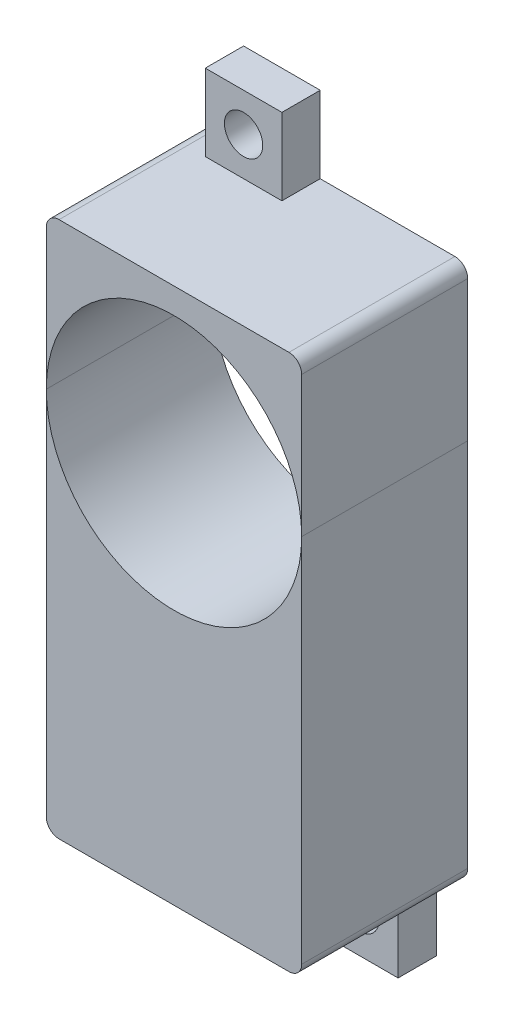
ISO-10303-21;
HEADER;
FILE_DESCRIPTION(('STEP AP214'),'2;1');
FILE_NAME('part.step','',(''),(''),'','','');
FILE_SCHEMA(('AUTOMOTIVE_DESIGN { 1 0 10303 214 1 1 1 1 }'));
ENDSEC;
DATA;
#1=APPLICATION_CONTEXT('core data for automotive mechanical design processes');
#2=APPLICATION_PROTOCOL_DEFINITION('international standard','automotive_design',2000,#1);
#3=PRODUCT_CONTEXT('',#1,'mechanical');
#4=PRODUCT('Part','Part','',(#3));
#5=PRODUCT_RELATED_PRODUCT_CATEGORY('part','',(#4));
#6=PRODUCT_DEFINITION_FORMATION('','',#4);
#7=PRODUCT_DEFINITION_CONTEXT('part definition',#1,'design');
#8=PRODUCT_DEFINITION('design','',#6,#7);
#9=PRODUCT_DEFINITION_SHAPE('','',#8);
#10=(LENGTH_UNIT() NAMED_UNIT(*) SI_UNIT(.MILLI.,.METRE.));
#11=(NAMED_UNIT(*) PLANE_ANGLE_UNIT() SI_UNIT($,.RADIAN.));
#12=(NAMED_UNIT(*) SI_UNIT($,.STERADIAN.) SOLID_ANGLE_UNIT());
#13=UNCERTAINTY_MEASURE_WITH_UNIT(LENGTH_MEASURE(1.E-05),#10,'distance_accuracy_value','');
#14=(GEOMETRIC_REPRESENTATION_CONTEXT(3) GLOBAL_UNCERTAINTY_ASSIGNED_CONTEXT((#13)) GLOBAL_UNIT_ASSIGNED_CONTEXT((#10,
#11,#12)) REPRESENTATION_CONTEXT('',''));
#15=CARTESIAN_POINT('',(0.,0.,0.));
#16=DIRECTION('',(0.,0.,1.));
#17=DIRECTION('',(1.,0.,0.));
#18=AXIS2_PLACEMENT_3D('',#15,#16,#17);
#19=CARTESIAN_POINT('',(1.55,0.,6.5));
#20=DIRECTION('',(-1.,0.,0.));
#21=DIRECTION('',(0.,0.,1.));
#22=AXIS2_PLACEMENT_3D('',#19,#20,#21);
#23=PLANE('',#22);
#24=DIRECTION('',(0.,0.,-1.));
#25=VECTOR('',#24,1.);
#26=CARTESIAN_POINT('',(1.55,-36.1570833214186,6.5));
#27=LINE('',#26,#25);
#28=CARTESIAN_POINT('',(1.55,-36.1570833214186,-3.5));
#29=VERTEX_POINT('',#28);
#30=CARTESIAN_POINT('',(1.55,-36.1570833214186,-6.5));
#31=VERTEX_POINT('',#30);
#32=EDGE_CURVE('E209',#29,#31,#27,.T.);
#33=ORIENTED_EDGE('',*,*,#32,.F.);
#34=DIRECTION('',(0.,-1.,0.));
#35=VECTOR('',#34,1.);
#36=CARTESIAN_POINT('',(1.55,-30.,-3.5));
#37=LINE('',#36,#35);
#38=CARTESIAN_POINT('',(1.55,-30.,-3.5));
#39=VERTEX_POINT('',#38);
#40=EDGE_CURVE('E369',#39,#29,#37,.T.);
#41=ORIENTED_EDGE('',*,*,#40,.F.);
#42=DIRECTION('',(0.,0.,-1.));
#43=VECTOR('',#42,1.);
#44=CARTESIAN_POINT('',(1.55,-30.,6.5));
#45=LINE('',#44,#43);
#46=CARTESIAN_POINT('',(1.55,-30.,-6.5));
#47=VERTEX_POINT('',#46);
#48=EDGE_CURVE('E212',#39,#47,#45,.T.);
#49=ORIENTED_EDGE('',*,*,#48,.T.);
#50=DIRECTION('',(0.,1.,0.));
#51=VECTOR('',#50,1.);
#52=CARTESIAN_POINT('',(1.55,0.,-6.5));
#53=LINE('',#52,#51);
#54=EDGE_CURVE('E189',#31,#47,#53,.T.);
#55=ORIENTED_EDGE('',*,*,#54,.F.);
#56=EDGE_LOOP('',(#33,#41,#49,#55));
#57=FACE_BOUND('',#56,.T.);
#58=ADVANCED_FACE('F51',(#57),#23,.T.);
#59=CARTESIAN_POINT('',(0.,-36.1570833214186,6.5));
#60=DIRECTION('',(0.,-1.,0.));
#61=DIRECTION('',(1.,0.,0.));
#62=AXIS2_PLACEMENT_3D('',#59,#60,#61);
#63=PLANE('',#62);
#64=DIRECTION('',(0.,0.,-1.));
#65=VECTOR('',#64,1.);
#66=CARTESIAN_POINT('',(7.55,-36.1570833214186,6.5));
#67=LINE('',#66,#65);
#68=CARTESIAN_POINT('',(7.55,-36.1570833214186,-3.5));
#69=VERTEX_POINT('',#68);
#70=CARTESIAN_POINT('',(7.55,-36.1570833214186,-6.5));
#71=VERTEX_POINT('',#70);
#72=EDGE_CURVE('E107',#69,#71,#67,.T.);
#73=ORIENTED_EDGE('',*,*,#72,.F.);
#74=DIRECTION('',(1.,0.,0.));
#75=VECTOR('',#74,1.);
#76=CARTESIAN_POINT('',(1.55,-36.1570833214186,-3.5));
#77=LINE('',#76,#75);
#78=EDGE_CURVE('E364',#29,#69,#77,.T.);
#79=ORIENTED_EDGE('',*,*,#78,.F.);
#80=ORIENTED_EDGE('',*,*,#32,.T.);
#81=DIRECTION('',(-1.,0.,0.));
#82=VECTOR('',#81,1.);
#83=CARTESIAN_POINT('',(0.,-36.1570833214186,-6.5));
#84=LINE('',#83,#82);
#85=EDGE_CURVE('E193',#71,#31,#84,.T.);
#86=ORIENTED_EDGE('',*,*,#85,.F.);
#87=EDGE_LOOP('',(#73,#79,#80,#86));
#88=FACE_BOUND('',#87,.T.);
#89=ADVANCED_FACE('F248',(#88),#63,.T.);
#90=CARTESIAN_POINT('',(7.55,0.,6.5));
#91=DIRECTION('',(1.,0.,0.));
#92=DIRECTION('',(0.,0.,-1.));
#93=AXIS2_PLACEMENT_3D('',#90,#91,#92);
#94=PLANE('',#93);
#95=DIRECTION('',(0.,0.,-1.));
#96=VECTOR('',#95,1.);
#97=CARTESIAN_POINT('',(7.55,-30.,6.5));
#98=LINE('',#97,#96);
#99=CARTESIAN_POINT('',(7.55,-30.,-3.5));
#100=VERTEX_POINT('',#99);
#101=CARTESIAN_POINT('',(7.55,-30.,-6.5));
#102=VERTEX_POINT('',#101);
#103=EDGE_CURVE('E114',#100,#102,#98,.T.);
#104=ORIENTED_EDGE('',*,*,#103,.F.);
#105=DIRECTION('',(0.,1.,0.));
#106=VECTOR('',#105,1.);
#107=CARTESIAN_POINT('',(7.55,-36.1570833214186,-3.5));
#108=LINE('',#107,#106);
#109=EDGE_CURVE('E355',#69,#100,#108,.T.);
#110=ORIENTED_EDGE('',*,*,#109,.F.);
#111=ORIENTED_EDGE('',*,*,#72,.T.);
#112=DIRECTION('',(0.,-1.,0.));
#113=VECTOR('',#112,1.);
#114=CARTESIAN_POINT('',(7.55,0.,-6.5));
#115=LINE('',#114,#113);
#116=EDGE_CURVE('E197',#102,#71,#115,.T.);
#117=ORIENTED_EDGE('',*,*,#116,.F.);
#118=EDGE_LOOP('',(#104,#110,#111,#117));
#119=FACE_BOUND('',#118,.T.);
#120=ADVANCED_FACE('F244',(#119),#94,.T.);
#121=CARTESIAN_POINT('',(4.55,-33.,6.5));
#122=DIRECTION('',(0.,0.,-1.));
#123=DIRECTION('',(-1.,0.,0.));
#124=AXIS2_PLACEMENT_3D('',#121,#122,#123);
#125=CYLINDRICAL_SURFACE('',#124,1.5);
#126=CARTESIAN_POINT('',(4.55,-33.,-6.5));
#127=DIRECTION('',(0.,0.,1.));
#128=DIRECTION('',(1.,0.,0.));
#129=AXIS2_PLACEMENT_3D('',#126,#127,#128);
#130=CIRCLE('',#129,1.5);
#131=CARTESIAN_POINT('',(6.05,-33.,-6.5));
#132=VERTEX_POINT('',#131);
#133=EDGE_CURVE('E201',#132,#132,#130,.T.);
#134=ORIENTED_EDGE('',*,*,#133,.F.);
#135=EDGE_LOOP('',(#134));
#136=FACE_BOUND('',#135,.T.);
#137=CARTESIAN_POINT('',(4.55,-33.,-3.5));
#138=DIRECTION('',(0.,0.,1.));
#139=DIRECTION('',(1.,0.,0.));
#140=AXIS2_PLACEMENT_3D('',#137,#138,#139);
#141=CIRCLE('',#140,1.5);
#142=CARTESIAN_POINT('',(6.05,-33.,-3.5));
#143=VERTEX_POINT('',#142);
#144=EDGE_CURVE('E55',#143,#143,#141,.T.);
#145=ORIENTED_EDGE('',*,*,#144,.T.);
#146=EDGE_LOOP('',(#145));
#147=FACE_BOUND('',#146,.T.);
#148=ADVANCED_FACE('F239',(#136,#147),#125,.F.);
#149=CARTESIAN_POINT('',(9.,-29.,6.5));
#150=DIRECTION('',(0.,0.,-1.));
#151=DIRECTION('',(-1.,0.,0.));
#152=AXIS2_PLACEMENT_3D('',#149,#150,#151);
#153=CYLINDRICAL_SURFACE('',#152,1.);
#154=CARTESIAN_POINT('',(9.,-29.,-6.5));
#155=DIRECTION('',(0.,0.,1.));
#156=DIRECTION('',(1.,0.,0.));
#157=AXIS2_PLACEMENT_3D('',#154,#155,#156);
#158=CIRCLE('',#157,1.);
#159=CARTESIAN_POINT('',(9.,-30.,-6.5));
#160=VERTEX_POINT('',#159);
#161=CARTESIAN_POINT('',(10.,-29.,-6.5));
#162=VERTEX_POINT('',#161);
#163=EDGE_CURVE('E170',#160,#162,#158,.T.);
#164=ORIENTED_EDGE('',*,*,#163,.T.);
#165=DIRECTION('',(0.,0.,-1.));
#166=VECTOR('',#165,1.);
#167=CARTESIAN_POINT('',(10.,-29.,6.5));
#168=LINE('',#167,#166);
#169=CARTESIAN_POINT('',(10.,-29.,6.5));
#170=VERTEX_POINT('',#169);
#171=EDGE_CURVE('E62',#170,#162,#168,.T.);
#172=ORIENTED_EDGE('',*,*,#171,.F.);
#173=CARTESIAN_POINT('',(9.,-29.,6.5));
#174=DIRECTION('',(0.,0.,1.));
#175=DIRECTION('',(1.,0.,0.));
#176=AXIS2_PLACEMENT_3D('',#173,#174,#175);
#177=CIRCLE('',#176,1.);
#178=CARTESIAN_POINT('',(9.,-30.,6.5));
#179=VERTEX_POINT('',#178);
#180=EDGE_CURVE('E122',#179,#170,#177,.T.);
#181=ORIENTED_EDGE('',*,*,#180,.F.);
#182=DIRECTION('',(0.,0.,-1.));
#183=VECTOR('',#182,1.);
#184=CARTESIAN_POINT('',(9.,-30.,6.5));
#185=LINE('',#184,#183);
#186=EDGE_CURVE('E12',#179,#160,#185,.T.);
#187=ORIENTED_EDGE('',*,*,#186,.T.);
#188=EDGE_LOOP('',(#164,#172,#181,#187));
#189=FACE_BOUND('',#188,.T.);
#190=ADVANCED_FACE('F53',(#189),#153,.T.);
#191=CARTESIAN_POINT('',(10.,0.,6.5));
#192=DIRECTION('',(-1.,0.,0.));
#193=DIRECTION('',(0.,0.,1.));
#194=AXIS2_PLACEMENT_3D('',#191,#192,#193);
#195=PLANE('',#194);
#196=DIRECTION('',(0.,1.,0.));
#197=VECTOR('',#196,1.);
#198=CARTESIAN_POINT('',(10.,0.,-6.5));
#199=LINE('',#198,#197);
#200=CARTESIAN_POINT('',(10.,0.,-6.5));
#201=VERTEX_POINT('',#200);
#202=EDGE_CURVE('E173',#162,#201,#199,.T.);
#203=ORIENTED_EDGE('',*,*,#202,.T.);
#204=DIRECTION('',(0.,0.,-1.));
#205=VECTOR('',#204,1.);
#206=CARTESIAN_POINT('',(10.,0.,6.5));
#207=LINE('',#206,#205);
#208=CARTESIAN_POINT('',(10.,0.,6.5));
#209=VERTEX_POINT('',#208);
#210=EDGE_CURVE('E143',#209,#201,#207,.T.);
#211=ORIENTED_EDGE('',*,*,#210,.F.);
#212=DIRECTION('',(0.,1.,0.));
#213=VECTOR('',#212,1.);
#214=CARTESIAN_POINT('',(10.,0.,6.5));
#215=LINE('',#214,#213);
#216=EDGE_CURVE('E157',#170,#209,#215,.T.);
#217=ORIENTED_EDGE('',*,*,#216,.F.);
#218=ORIENTED_EDGE('',*,*,#171,.T.);
#219=EDGE_LOOP('',(#203,#211,#217,#218));
#220=FACE_BOUND('',#219,.T.);
#221=ADVANCED_FACE('F226',(#220),#195,.F.);
#222=CARTESIAN_POINT('',(0.,0.,6.5));
#223=DIRECTION('',(0.,0.,-1.));
#224=DIRECTION('',(-1.,0.,0.));
#225=AXIS2_PLACEMENT_3D('',#222,#223,#224);
#226=CYLINDRICAL_SURFACE('',#225,10.);
#227=CARTESIAN_POINT('',(0.,0.,-6.5));
#228=DIRECTION('',(0.,0.,1.));
#229=DIRECTION('',(1.,0.,0.));
#230=AXIS2_PLACEMENT_3D('',#227,#228,#229);
#231=CIRCLE('',#230,10.);
#232=CARTESIAN_POINT('',(-10.,0.,-6.5));
#233=VERTEX_POINT('',#232);
#234=EDGE_CURVE('E139',#233,#201,#231,.T.);
#235=ORIENTED_EDGE('',*,*,#234,.F.);
#236=DIRECTION('',(0.,0.,-1.));
#237=VECTOR('',#236,1.);
#238=CARTESIAN_POINT('',(-10.,0.,6.5));
#239=LINE('',#238,#237);
#240=CARTESIAN_POINT('',(-10.,0.,6.5));
#241=VERTEX_POINT('',#240);
#242=EDGE_CURVE('E133',#241,#233,#239,.T.);
#243=ORIENTED_EDGE('',*,*,#242,.F.);
#244=CARTESIAN_POINT('',(0.,0.,6.5));
#245=DIRECTION('',(0.,0.,1.));
#246=DIRECTION('',(1.,0.,0.));
#247=AXIS2_PLACEMENT_3D('',#244,#245,#246);
#248=CIRCLE('',#247,10.);
#249=EDGE_CURVE('E137',#241,#209,#248,.T.);
#250=ORIENTED_EDGE('',*,*,#249,.T.);
#251=ORIENTED_EDGE('',*,*,#210,.T.);
#252=EDGE_LOOP('',(#235,#243,#250,#251));
#253=FACE_BOUND('',#252,.T.);
#254=ADVANCED_FACE('F135',(#253),#226,.F.);
#255=CARTESIAN_POINT('',(-10.,0.,6.5));
#256=DIRECTION('',(1.,0.,0.));
#257=DIRECTION('',(0.,1.,0.));
#258=AXIS2_PLACEMENT_3D('',#255,#256,#257);
#259=PLANE('',#258);
#260=DIRECTION('',(0.,-1.,0.));
#261=VECTOR('',#260,1.);
#262=CARTESIAN_POINT('',(-10.,0.,-6.5));
#263=LINE('',#262,#261);
#264=CARTESIAN_POINT('',(-10.,-29.,-6.5));
#265=VERTEX_POINT('',#264);
#266=EDGE_CURVE('E179',#233,#265,#263,.T.);
#267=ORIENTED_EDGE('',*,*,#266,.T.);
#268=DIRECTION('',(0.,0.,-1.));
#269=VECTOR('',#268,1.);
#270=CARTESIAN_POINT('',(-10.,-29.,6.5));
#271=LINE('',#270,#269);
#272=CARTESIAN_POINT('',(-10.,-29.,6.5));
#273=VERTEX_POINT('',#272);
#274=EDGE_CURVE('E144',#273,#265,#271,.T.);
#275=ORIENTED_EDGE('',*,*,#274,.F.);
#276=DIRECTION('',(0.,-1.,0.));
#277=VECTOR('',#276,1.);
#278=CARTESIAN_POINT('',(-10.,0.,6.5));
#279=LINE('',#278,#277);
#280=EDGE_CURVE('E147',#241,#273,#279,.T.);
#281=ORIENTED_EDGE('',*,*,#280,.F.);
#282=ORIENTED_EDGE('',*,*,#242,.T.);
#283=EDGE_LOOP('',(#267,#275,#281,#282));
#284=FACE_BOUND('',#283,.T.);
#285=ADVANCED_FACE('F148',(#284),#259,.F.);
#286=CARTESIAN_POINT('',(-9.,-29.,6.5));
#287=DIRECTION('',(0.,0.,-1.));
#288=DIRECTION('',(-1.,0.,0.));
#289=AXIS2_PLACEMENT_3D('',#286,#287,#288);
#290=CYLINDRICAL_SURFACE('',#289,1.);
#291=CARTESIAN_POINT('',(-9.,-29.,-6.5));
#292=DIRECTION('',(0.,0.,1.));
#293=DIRECTION('',(1.,0.,0.));
#294=AXIS2_PLACEMENT_3D('',#291,#292,#293);
#295=CIRCLE('',#294,1.);
#296=CARTESIAN_POINT('',(-9.,-30.,-6.5));
#297=VERTEX_POINT('',#296);
#298=EDGE_CURVE('E182',#265,#297,#295,.T.);
#299=ORIENTED_EDGE('',*,*,#298,.T.);
#300=DIRECTION('',(0.,0.,-1.));
#301=VECTOR('',#300,1.);
#302=CARTESIAN_POINT('',(-9.,-30.,6.5));
#303=LINE('',#302,#301);
#304=CARTESIAN_POINT('',(-9.,-30.,6.5));
#305=VERTEX_POINT('',#304);
#306=EDGE_CURVE('E215',#305,#297,#303,.T.);
#307=ORIENTED_EDGE('',*,*,#306,.F.);
#308=CARTESIAN_POINT('',(-9.,-29.,6.5));
#309=DIRECTION('',(0.,0.,1.));
#310=DIRECTION('',(1.,0.,0.));
#311=AXIS2_PLACEMENT_3D('',#308,#309,#310);
#312=CIRCLE('',#311,1.);
#313=EDGE_CURVE('E153',#273,#305,#312,.T.);
#314=ORIENTED_EDGE('',*,*,#313,.F.);
#315=ORIENTED_EDGE('',*,*,#274,.T.);
#316=EDGE_LOOP('',(#299,#307,#314,#315));
#317=FACE_BOUND('',#316,.T.);
#318=ADVANCED_FACE('F233',(#317),#290,.T.);
#319=CARTESIAN_POINT('',(0.,-30.,6.5));
#320=DIRECTION('',(0.,1.,0.));
#321=DIRECTION('',(0.,0.,1.));
#322=AXIS2_PLACEMENT_3D('',#319,#320,#321);
#323=PLANE('',#322);
#324=DIRECTION('',(1.,0.,0.));
#325=VECTOR('',#324,1.);
#326=CARTESIAN_POINT('',(0.,-30.,-6.5));
#327=LINE('',#326,#325);
#328=EDGE_CURVE('E185',#297,#47,#327,.T.);
#329=ORIENTED_EDGE('',*,*,#328,.T.);
#330=ORIENTED_EDGE('',*,*,#48,.F.);
#331=DIRECTION('',(-1.,0.,0.));
#332=VECTOR('',#331,1.);
#333=CARTESIAN_POINT('',(7.55,-30.,-3.5));
#334=LINE('',#333,#332);
#335=EDGE_CURVE('E358',#100,#39,#334,.T.);
#336=ORIENTED_EDGE('',*,*,#335,.F.);
#337=ORIENTED_EDGE('',*,*,#103,.T.);
#338=DIRECTION('',(1.,0.,0.));
#339=VECTOR('',#338,1.);
#340=CARTESIAN_POINT('',(0.,-30.,-6.5));
#341=LINE('',#340,#339);
#342=EDGE_CURVE('E167',#102,#160,#341,.T.);
#343=ORIENTED_EDGE('',*,*,#342,.T.);
#344=ORIENTED_EDGE('',*,*,#186,.F.);
#345=DIRECTION('',(1.,0.,0.));
#346=VECTOR('',#345,1.);
#347=CARTESIAN_POINT('',(0.,-30.,6.5));
#348=LINE('',#347,#346);
#349=EDGE_CURVE('E70',#305,#179,#348,.T.);
#350=ORIENTED_EDGE('',*,*,#349,.F.);
#351=ORIENTED_EDGE('',*,*,#306,.T.);
#352=EDGE_LOOP('',(#329,#330,#336,#337,#343,#344,#350,#351));
#353=FACE_BOUND('',#352,.T.);
#354=ADVANCED_FACE('F237',(#353),#323,.F.);
#355=CARTESIAN_POINT('',(0.,0.,6.5));
#356=DIRECTION('',(0.,0.,1.));
#357=DIRECTION('',(1.,0.,0.));
#358=AXIS2_PLACEMENT_3D('',#355,#356,#357);
#359=PLANE('',#358);
#360=ORIENTED_EDGE('',*,*,#313,.T.);
#361=ORIENTED_EDGE('',*,*,#349,.T.);
#362=ORIENTED_EDGE('',*,*,#180,.T.);
#363=ORIENTED_EDGE('',*,*,#216,.T.);
#364=ORIENTED_EDGE('',*,*,#249,.F.);
#365=ORIENTED_EDGE('',*,*,#280,.T.);
#366=EDGE_LOOP('',(#360,#361,#362,#363,#364,#365));
#367=FACE_BOUND('',#366,.T.);
#368=ADVANCED_FACE('F155',(#367),#359,.T.);
#369=CARTESIAN_POINT('',(0.,0.,-6.5));
#370=DIRECTION('',(0.,0.,1.));
#371=DIRECTION('',(1.,0.,0.));
#372=AXIS2_PLACEMENT_3D('',#369,#370,#371);
#373=PLANE('',#372);
#374=ORIENTED_EDGE('',*,*,#342,.F.);
#375=ORIENTED_EDGE('',*,*,#116,.T.);
#376=ORIENTED_EDGE('',*,*,#85,.T.);
#377=ORIENTED_EDGE('',*,*,#54,.T.);
#378=ORIENTED_EDGE('',*,*,#328,.F.);
#379=ORIENTED_EDGE('',*,*,#298,.F.);
#380=ORIENTED_EDGE('',*,*,#266,.F.);
#381=ORIENTED_EDGE('',*,*,#234,.T.);
#382=ORIENTED_EDGE('',*,*,#202,.F.);
#383=ORIENTED_EDGE('',*,*,#163,.F.);
#384=EDGE_LOOP('',(#374,#375,#376,#377,#378,#379,#380,#381,#382,#383));
#385=FACE_BOUND('',#384,.T.);
#386=ORIENTED_EDGE('',*,*,#133,.T.);
#387=EDGE_LOOP('',(#386));
#388=FACE_BOUND('',#387,.T.);
#389=ADVANCED_FACE('F228',(#385,#388),#373,.F.);
#390=CARTESIAN_POINT('',(0.,0.,-3.5));
#391=DIRECTION('',(0.,0.,1.));
#392=DIRECTION('',(1.,0.,0.));
#393=AXIS2_PLACEMENT_3D('',#390,#391,#392);
#394=PLANE('',#393);
#395=ORIENTED_EDGE('',*,*,#144,.F.);
#396=EDGE_LOOP('',(#395));
#397=FACE_BOUND('',#396,.T.);
#398=ORIENTED_EDGE('',*,*,#335,.T.);
#399=ORIENTED_EDGE('',*,*,#40,.T.);
#400=ORIENTED_EDGE('',*,*,#78,.T.);
#401=ORIENTED_EDGE('',*,*,#109,.T.);
#402=EDGE_LOOP('',(#398,#399,#400,#401));
#403=FACE_BOUND('',#402,.T.);
#404=ADVANCED_FACE('F296',(#397,#403),#394,.T.);
#405=CLOSED_SHELL('',(#58,#89,#120,#148,#190,#221,#254,#285,#318,#354,#368,#389,#404));
#406=MANIFOLD_SOLID_BREP('B2',#405);
#407=CARTESIAN_POINT('',(-1.54999999999999,0.,6.5));
#408=DIRECTION('',(-1.,0.,0.));
#409=DIRECTION('',(0.,-1.,0.));
#410=AXIS2_PLACEMENT_3D('',#407,#408,#409);
#411=PLANE('',#410);
#412=DIRECTION('',(0.,1.,0.));
#413=VECTOR('',#412,1.);
#414=CARTESIAN_POINT('',(-1.55,12.,-3.5));
#415=LINE('',#414,#413);
#416=CARTESIAN_POINT('',(-1.55,12.,-3.5));
#417=VERTEX_POINT('',#416);
#418=CARTESIAN_POINT('',(-1.55,18.,-3.5));
#419=VERTEX_POINT('',#418);
#420=EDGE_CURVE('E570',#417,#419,#415,.T.);
#421=ORIENTED_EDGE('',*,*,#420,.F.);
#422=DIRECTION('',(0.,0.,-1.));
#423=VECTOR('',#422,1.);
#424=CARTESIAN_POINT('',(-1.55,12.,6.5));
#425=LINE('',#424,#423);
#426=CARTESIAN_POINT('',(-1.55,12.,-6.5));
#427=VERTEX_POINT('',#426);
#428=EDGE_CURVE('E49',#417,#427,#425,.T.);
#429=ORIENTED_EDGE('',*,*,#428,.T.);
#430=DIRECTION('',(0.,1.,0.));
#431=VECTOR('',#430,1.);
#432=CARTESIAN_POINT('',(-1.54999999999999,0.,-6.5));
#433=LINE('',#432,#431);
#434=CARTESIAN_POINT('',(-1.55,18.,-6.5));
#435=VERTEX_POINT('',#434);
#436=EDGE_CURVE('E504',#427,#435,#433,.T.);
#437=ORIENTED_EDGE('',*,*,#436,.T.);
#438=DIRECTION('',(0.,0.,-1.));
#439=VECTOR('',#438,1.);
#440=CARTESIAN_POINT('',(-1.55,18.,6.5));
#441=LINE('',#440,#439);
#442=EDGE_CURVE('E411',#419,#435,#441,.T.);
#443=ORIENTED_EDGE('',*,*,#442,.F.);
#444=EDGE_LOOP('',(#421,#429,#437,#443));
#445=FACE_BOUND('',#444,.T.);
#446=ADVANCED_FACE('F402',(#445),#411,.F.);
#447=CARTESIAN_POINT('',(0.,18.,6.5));
#448=DIRECTION('',(0.,1.,0.));
#449=DIRECTION('',(0.,0.,1.));
#450=AXIS2_PLACEMENT_3D('',#447,#448,#449);
#451=PLANE('',#450);
#452=DIRECTION('',(0.,0.,-1.));
#453=VECTOR('',#452,1.);
#454=CARTESIAN_POINT('',(-7.55,18.,6.5));
#455=LINE('',#454,#453);
#456=CARTESIAN_POINT('',(-7.55,18.,-3.5));
#457=VERTEX_POINT('',#456);
#458=CARTESIAN_POINT('',(-7.55,18.,-6.5));
#459=VERTEX_POINT('',#458);
#460=EDGE_CURVE('E537',#457,#459,#455,.T.);
#461=ORIENTED_EDGE('',*,*,#460,.F.);
#462=DIRECTION('',(-1.,0.,0.));
#463=VECTOR('',#462,1.);
#464=CARTESIAN_POINT('',(-1.55,18.,-3.5));
#465=LINE('',#464,#463);
#466=EDGE_CURVE('E547',#419,#457,#465,.T.);
#467=ORIENTED_EDGE('',*,*,#466,.F.);
#468=ORIENTED_EDGE('',*,*,#442,.T.);
#469=DIRECTION('',(1.,0.,0.));
#470=VECTOR('',#469,1.);
#471=CARTESIAN_POINT('',(0.,18.,-6.5));
#472=LINE('',#471,#470);
#473=EDGE_CURVE('E507',#459,#435,#472,.T.);
#474=ORIENTED_EDGE('',*,*,#473,.F.);
#475=EDGE_LOOP('',(#461,#467,#468,#474));
#476=FACE_BOUND('',#475,.T.);
#477=ADVANCED_FACE('F544',(#476),#451,.T.);
#478=CARTESIAN_POINT('',(-7.55,0.,6.5));
#479=DIRECTION('',(-1.,0.,0.));
#480=DIRECTION('',(0.,0.,1.));
#481=AXIS2_PLACEMENT_3D('',#478,#479,#480);
#482=PLANE('',#481);
#483=DIRECTION('',(0.,0.,-1.));
#484=VECTOR('',#483,1.);
#485=CARTESIAN_POINT('',(-7.55,12.,6.5));
#486=LINE('',#485,#484);
#487=CARTESIAN_POINT('',(-7.55,12.,-3.5));
#488=VERTEX_POINT('',#487);
#489=CARTESIAN_POINT('',(-7.55,12.,-6.5));
#490=VERTEX_POINT('',#489);
#491=EDGE_CURVE('E535',#488,#490,#486,.T.);
#492=ORIENTED_EDGE('',*,*,#491,.F.);
#493=DIRECTION('',(0.,-1.,0.));
#494=VECTOR('',#493,1.);
#495=CARTESIAN_POINT('',(-7.55,18.,-3.5));
#496=LINE('',#495,#494);
#497=EDGE_CURVE('E565',#457,#488,#496,.T.);
#498=ORIENTED_EDGE('',*,*,#497,.F.);
#499=ORIENTED_EDGE('',*,*,#460,.T.);
#500=DIRECTION('',(0.,1.,0.));
#501=VECTOR('',#500,1.);
#502=CARTESIAN_POINT('',(-7.55,0.,-6.5));
#503=LINE('',#502,#501);
#504=EDGE_CURVE('E510',#490,#459,#503,.T.);
#505=ORIENTED_EDGE('',*,*,#504,.F.);
#506=EDGE_LOOP('',(#492,#498,#499,#505));
#507=FACE_BOUND('',#506,.T.);
#508=ADVANCED_FACE('F561',(#507),#482,.T.);
#509=CARTESIAN_POINT('',(-4.55,15.,6.5));
#510=DIRECTION('',(0.,0.,-1.));
#511=DIRECTION('',(-1.,0.,0.));
#512=AXIS2_PLACEMENT_3D('',#509,#510,#511);
#513=CYLINDRICAL_SURFACE('',#512,1.5);
#514=CARTESIAN_POINT('',(-4.55,15.,-6.5));
#515=DIRECTION('',(0.,0.,1.));
#516=DIRECTION('',(1.,0.,0.));
#517=AXIS2_PLACEMENT_3D('',#514,#515,#516);
#518=CIRCLE('',#517,1.5);
#519=CARTESIAN_POINT('',(-3.05,15.,-6.5));
#520=VERTEX_POINT('',#519);
#521=EDGE_CURVE('E524',#520,#520,#518,.T.);
#522=ORIENTED_EDGE('',*,*,#521,.F.);
#523=EDGE_LOOP('',(#522));
#524=FACE_BOUND('',#523,.T.);
#525=CARTESIAN_POINT('',(-4.55,15.,-3.5));
#526=DIRECTION('',(0.,0.,1.));
#527=DIRECTION('',(1.,0.,0.));
#528=AXIS2_PLACEMENT_3D('',#525,#526,#527);
#529=CIRCLE('',#528,1.5);
#530=CARTESIAN_POINT('',(-3.05,15.,-3.5));
#531=VERTEX_POINT('',#530);
#532=EDGE_CURVE('E405',#531,#531,#529,.T.);
#533=ORIENTED_EDGE('',*,*,#532,.T.);
#534=EDGE_LOOP('',(#533));
#535=FACE_BOUND('',#534,.T.);
#536=ADVANCED_FACE('F607',(#524,#535),#513,.F.);
#537=CARTESIAN_POINT('',(0.,12.,6.5));
#538=DIRECTION('',(0.,-1.,0.));
#539=DIRECTION('',(1.,0.,0.));
#540=AXIS2_PLACEMENT_3D('',#537,#538,#539);
#541=PLANE('',#540);
#542=DIRECTION('',(-1.,0.,0.));
#543=VECTOR('',#542,1.);
#544=CARTESIAN_POINT('',(0.,12.,-6.5));
#545=LINE('',#544,#543);
#546=CARTESIAN_POINT('',(-9.,12.,-6.5));
#547=VERTEX_POINT('',#546);
#548=EDGE_CURVE('E513',#490,#547,#545,.T.);
#549=ORIENTED_EDGE('',*,*,#548,.T.);
#550=DIRECTION('',(0.,0.,-1.));
#551=VECTOR('',#550,1.);
#552=CARTESIAN_POINT('',(-9.,12.,6.5));
#553=LINE('',#552,#551);
#554=CARTESIAN_POINT('',(-9.,12.,6.5));
#555=VERTEX_POINT('',#554);
#556=EDGE_CURVE('E532',#555,#547,#553,.T.);
#557=ORIENTED_EDGE('',*,*,#556,.F.);
#558=DIRECTION('',(-1.,0.,0.));
#559=VECTOR('',#558,1.);
#560=CARTESIAN_POINT('',(0.,12.,6.5));
#561=LINE('',#560,#559);
#562=CARTESIAN_POINT('',(9.,12.,6.5));
#563=VERTEX_POINT('',#562);
#564=EDGE_CURVE('E465',#563,#555,#561,.T.);
#565=ORIENTED_EDGE('',*,*,#564,.F.);
#566=DIRECTION('',(0.,0.,-1.));
#567=VECTOR('',#566,1.);
#568=CARTESIAN_POINT('',(9.,12.,6.5));
#569=LINE('',#568,#567);
#570=CARTESIAN_POINT('',(9.,12.,-6.5));
#571=VERTEX_POINT('',#570);
#572=EDGE_CURVE('E500',#563,#571,#569,.T.);
#573=ORIENTED_EDGE('',*,*,#572,.T.);
#574=DIRECTION('',(-1.,0.,0.));
#575=VECTOR('',#574,1.);
#576=CARTESIAN_POINT('',(0.,12.,-6.5));
#577=LINE('',#576,#575);
#578=EDGE_CURVE('E501',#571,#427,#577,.T.);
#579=ORIENTED_EDGE('',*,*,#578,.T.);
#580=ORIENTED_EDGE('',*,*,#428,.F.);
#581=DIRECTION('',(1.,0.,0.));
#582=VECTOR('',#581,1.);
#583=CARTESIAN_POINT('',(-7.55,12.,-3.5));
#584=LINE('',#583,#582);
#585=EDGE_CURVE('E575',#488,#417,#584,.T.);
#586=ORIENTED_EDGE('',*,*,#585,.F.);
#587=ORIENTED_EDGE('',*,*,#491,.T.);
#588=EDGE_LOOP('',(#549,#557,#565,#573,#579,#580,#586,#587));
#589=FACE_BOUND('',#588,.T.);
#590=ADVANCED_FACE('F576',(#589),#541,.F.);
#591=CARTESIAN_POINT('',(-9.,11.,6.5));
#592=DIRECTION('',(0.,0.,-1.));
#593=DIRECTION('',(-1.,0.,0.));
#594=AXIS2_PLACEMENT_3D('',#591,#592,#593);
#595=CYLINDRICAL_SURFACE('',#594,1.);
#596=CARTESIAN_POINT('',(-9.,11.,-6.5));
#597=DIRECTION('',(0.,0.,1.));
#598=DIRECTION('',(1.,0.,0.));
#599=AXIS2_PLACEMENT_3D('',#596,#597,#598);
#600=CIRCLE('',#599,1.);
#601=CARTESIAN_POINT('',(-10.,11.,-6.5));
#602=VERTEX_POINT('',#601);
#603=EDGE_CURVE('E515',#547,#602,#600,.T.);
#604=ORIENTED_EDGE('',*,*,#603,.T.);
#605=DIRECTION('',(0.,0.,-1.));
#606=VECTOR('',#605,1.);
#607=CARTESIAN_POINT('',(-10.,11.,6.5));
#608=LINE('',#607,#606);
#609=CARTESIAN_POINT('',(-10.,11.,6.5));
#610=VERTEX_POINT('',#609);
#611=EDGE_CURVE('E530',#610,#602,#608,.T.);
#612=ORIENTED_EDGE('',*,*,#611,.F.);
#613=CARTESIAN_POINT('',(-9.,11.,6.5));
#614=DIRECTION('',(0.,0.,1.));
#615=DIRECTION('',(1.,0.,0.));
#616=AXIS2_PLACEMENT_3D('',#613,#614,#615);
#617=CIRCLE('',#616,1.);
#618=EDGE_CURVE('E495',#555,#610,#617,.T.);
#619=ORIENTED_EDGE('',*,*,#618,.F.);
#620=ORIENTED_EDGE('',*,*,#556,.T.);
#621=EDGE_LOOP('',(#604,#612,#619,#620));
#622=FACE_BOUND('',#621,.T.);
#623=ADVANCED_FACE('F586',(#622),#595,.T.);
#624=CARTESIAN_POINT('',(-10.,0.,6.5));
#625=DIRECTION('',(-1.,0.,0.));
#626=DIRECTION('',(0.,0.,1.));
#627=AXIS2_PLACEMENT_3D('',#624,#625,#626);
#628=PLANE('',#627);
#629=DIRECTION('',(0.,1.,0.));
#630=VECTOR('',#629,1.);
#631=CARTESIAN_POINT('',(-10.,0.,-6.5));
#632=LINE('',#631,#630);
#633=CARTESIAN_POINT('',(-10.,0.,-6.5));
#634=VERTEX_POINT('',#633);
#635=EDGE_CURVE('E518',#634,#602,#632,.T.);
#636=ORIENTED_EDGE('',*,*,#635,.F.);
#637=DIRECTION('',(0.,0.,-1.));
#638=VECTOR('',#637,1.);
#639=CARTESIAN_POINT('',(-10.,0.,6.5));
#640=LINE('',#639,#638);
#641=CARTESIAN_POINT('',(-10.,0.,6.5));
#642=VERTEX_POINT('',#641);
#643=EDGE_CURVE('E484',#642,#634,#640,.T.);
#644=ORIENTED_EDGE('',*,*,#643,.F.);
#645=DIRECTION('',(0.,1.,0.));
#646=VECTOR('',#645,1.);
#647=CARTESIAN_POINT('',(-10.,0.,6.5));
#648=LINE('',#647,#646);
#649=EDGE_CURVE('E493',#642,#610,#648,.T.);
#650=ORIENTED_EDGE('',*,*,#649,.T.);
#651=ORIENTED_EDGE('',*,*,#611,.T.);
#652=EDGE_LOOP('',(#636,#644,#650,#651));
#653=FACE_BOUND('',#652,.T.);
#654=ADVANCED_FACE('F589',(#653),#628,.T.);
#655=CARTESIAN_POINT('',(0.,0.,6.5));
#656=DIRECTION('',(0.,0.,-1.));
#657=DIRECTION('',(-1.,0.,0.));
#658=AXIS2_PLACEMENT_3D('',#655,#656,#657);
#659=CYLINDRICAL_SURFACE('',#658,10.);
#660=CARTESIAN_POINT('',(0.,0.,-6.5));
#661=DIRECTION('',(0.,0.,1.));
#662=DIRECTION('',(1.,0.,0.));
#663=AXIS2_PLACEMENT_3D('',#660,#661,#662);
#664=CIRCLE('',#663,10.);
#665=CARTESIAN_POINT('',(10.,0.,-6.5));
#666=VERTEX_POINT('',#665);
#667=EDGE_CURVE('E483',#666,#634,#664,.T.);
#668=ORIENTED_EDGE('',*,*,#667,.F.);
#669=DIRECTION('',(0.,0.,-1.));
#670=VECTOR('',#669,1.);
#671=CARTESIAN_POINT('',(10.,0.,6.5));
#672=LINE('',#671,#670);
#673=CARTESIAN_POINT('',(10.,0.,6.5));
#674=VERTEX_POINT('',#673);
#675=EDGE_CURVE('E477',#674,#666,#672,.T.);
#676=ORIENTED_EDGE('',*,*,#675,.F.);
#677=CARTESIAN_POINT('',(0.,0.,6.5));
#678=DIRECTION('',(0.,0.,1.));
#679=DIRECTION('',(1.,0.,0.));
#680=AXIS2_PLACEMENT_3D('',#677,#678,#679);
#681=CIRCLE('',#680,10.);
#682=EDGE_CURVE('E481',#674,#642,#681,.T.);
#683=ORIENTED_EDGE('',*,*,#682,.T.);
#684=ORIENTED_EDGE('',*,*,#643,.T.);
#685=EDGE_LOOP('',(#668,#676,#683,#684));
#686=FACE_BOUND('',#685,.T.);
#687=ADVANCED_FACE('F479',(#686),#659,.F.);
#688=CARTESIAN_POINT('',(10.,0.,6.5));
#689=DIRECTION('',(-1.,0.,0.));
#690=DIRECTION('',(0.,-1.,0.));
#691=AXIS2_PLACEMENT_3D('',#688,#689,#690);
#692=PLANE('',#691);
#693=DIRECTION('',(0.,1.,0.));
#694=VECTOR('',#693,1.);
#695=CARTESIAN_POINT('',(10.,0.,-6.5));
#696=LINE('',#695,#694);
#697=CARTESIAN_POINT('',(10.,11.,-6.5));
#698=VERTEX_POINT('',#697);
#699=EDGE_CURVE('E453',#666,#698,#696,.T.);
#700=ORIENTED_EDGE('',*,*,#699,.T.);
#701=DIRECTION('',(0.,0.,-1.));
#702=VECTOR('',#701,1.);
#703=CARTESIAN_POINT('',(10.,11.,6.5));
#704=LINE('',#703,#702);
#705=CARTESIAN_POINT('',(10.,11.,6.5));
#706=VERTEX_POINT('',#705);
#707=EDGE_CURVE('E485',#706,#698,#704,.T.);
#708=ORIENTED_EDGE('',*,*,#707,.F.);
#709=DIRECTION('',(0.,1.,0.));
#710=VECTOR('',#709,1.);
#711=CARTESIAN_POINT('',(10.,0.,6.5));
#712=LINE('',#711,#710);
#713=EDGE_CURVE('E487',#674,#706,#712,.T.);
#714=ORIENTED_EDGE('',*,*,#713,.F.);
#715=ORIENTED_EDGE('',*,*,#675,.T.);
#716=EDGE_LOOP('',(#700,#708,#714,#715));
#717=FACE_BOUND('',#716,.T.);
#718=ADVANCED_FACE('F488',(#717),#692,.F.);
#719=CARTESIAN_POINT('',(9.,11.,6.5));
#720=DIRECTION('',(0.,0.,-1.));
#721=DIRECTION('',(-1.,0.,0.));
#722=AXIS2_PLACEMENT_3D('',#719,#720,#721);
#723=CYLINDRICAL_SURFACE('',#722,1.);
#724=CARTESIAN_POINT('',(9.,11.,-6.5));
#725=DIRECTION('',(0.,0.,1.));
#726=DIRECTION('',(1.,0.,0.));
#727=AXIS2_PLACEMENT_3D('',#724,#725,#726);
#728=CIRCLE('',#727,1.);
#729=EDGE_CURVE('E459',#698,#571,#728,.T.);
#730=ORIENTED_EDGE('',*,*,#729,.T.);
#731=ORIENTED_EDGE('',*,*,#572,.F.);
#732=CARTESIAN_POINT('',(9.,11.,6.5));
#733=DIRECTION('',(0.,0.,1.));
#734=DIRECTION('',(1.,0.,0.));
#735=AXIS2_PLACEMENT_3D('',#732,#733,#734);
#736=CIRCLE('',#735,1.);
#737=EDGE_CURVE('E419',#706,#563,#736,.T.);
#738=ORIENTED_EDGE('',*,*,#737,.F.);
#739=ORIENTED_EDGE('',*,*,#707,.T.);
#740=EDGE_LOOP('',(#730,#731,#738,#739));
#741=FACE_BOUND('',#740,.T.);
#742=ADVANCED_FACE('F590',(#741),#723,.T.);
#743=CARTESIAN_POINT('',(0.,0.,6.5));
#744=DIRECTION('',(0.,0.,1.));
#745=DIRECTION('',(1.,0.,0.));
#746=AXIS2_PLACEMENT_3D('',#743,#744,#745);
#747=PLANE('',#746);
#748=ORIENTED_EDGE('',*,*,#564,.T.);
#749=ORIENTED_EDGE('',*,*,#618,.T.);
#750=ORIENTED_EDGE('',*,*,#649,.F.);
#751=ORIENTED_EDGE('',*,*,#682,.F.);
#752=ORIENTED_EDGE('',*,*,#713,.T.);
#753=ORIENTED_EDGE('',*,*,#737,.T.);
#754=EDGE_LOOP('',(#748,#749,#750,#751,#752,#753));
#755=FACE_BOUND('',#754,.T.);
#756=ADVANCED_FACE('F491',(#755),#747,.T.);
#757=CARTESIAN_POINT('',(0.,0.,-6.5));
#758=DIRECTION('',(0.,0.,1.));
#759=DIRECTION('',(1.,0.,0.));
#760=AXIS2_PLACEMENT_3D('',#757,#758,#759);
#761=PLANE('',#760);
#762=ORIENTED_EDGE('',*,*,#578,.F.);
#763=ORIENTED_EDGE('',*,*,#729,.F.);
#764=ORIENTED_EDGE('',*,*,#699,.F.);
#765=ORIENTED_EDGE('',*,*,#667,.T.);
#766=ORIENTED_EDGE('',*,*,#635,.T.);
#767=ORIENTED_EDGE('',*,*,#603,.F.);
#768=ORIENTED_EDGE('',*,*,#548,.F.);
#769=ORIENTED_EDGE('',*,*,#504,.T.);
#770=ORIENTED_EDGE('',*,*,#473,.T.);
#771=ORIENTED_EDGE('',*,*,#436,.F.);
#772=EDGE_LOOP('',(#762,#763,#764,#765,#766,#767,#768,#769,#770,#771));
#773=FACE_BOUND('',#772,.T.);
#774=ORIENTED_EDGE('',*,*,#521,.T.);
#775=EDGE_LOOP('',(#774));
#776=FACE_BOUND('',#775,.T.);
#777=ADVANCED_FACE('F554',(#773,#776),#761,.F.);
#778=CARTESIAN_POINT('',(0.,0.,-3.5));
#779=DIRECTION('',(0.,0.,1.));
#780=DIRECTION('',(1.,0.,0.));
#781=AXIS2_PLACEMENT_3D('',#778,#779,#780);
#782=PLANE('',#781);
#783=ORIENTED_EDGE('',*,*,#532,.F.);
#784=EDGE_LOOP('',(#783));
#785=FACE_BOUND('',#784,.T.);
#786=ORIENTED_EDGE('',*,*,#497,.T.);
#787=ORIENTED_EDGE('',*,*,#585,.T.);
#788=ORIENTED_EDGE('',*,*,#420,.T.);
#789=ORIENTED_EDGE('',*,*,#466,.T.);
#790=EDGE_LOOP('',(#786,#787,#788,#789));
#791=FACE_BOUND('',#790,.T.);
#792=ADVANCED_FACE('F578',(#785,#791),#782,.T.);
#793=CLOSED_SHELL('',(#446,#477,#508,#536,#590,#623,#654,#687,#718,#742,#756,#777,#792));
#794=MANIFOLD_SOLID_BREP('B6',#793);
#795=ADVANCED_BREP_SHAPE_REPRESENTATION('',(#18,#406,#794),#14);
#796=SHAPE_DEFINITION_REPRESENTATION(#9,#795);
ENDSEC;
END-ISO-10303-21;
